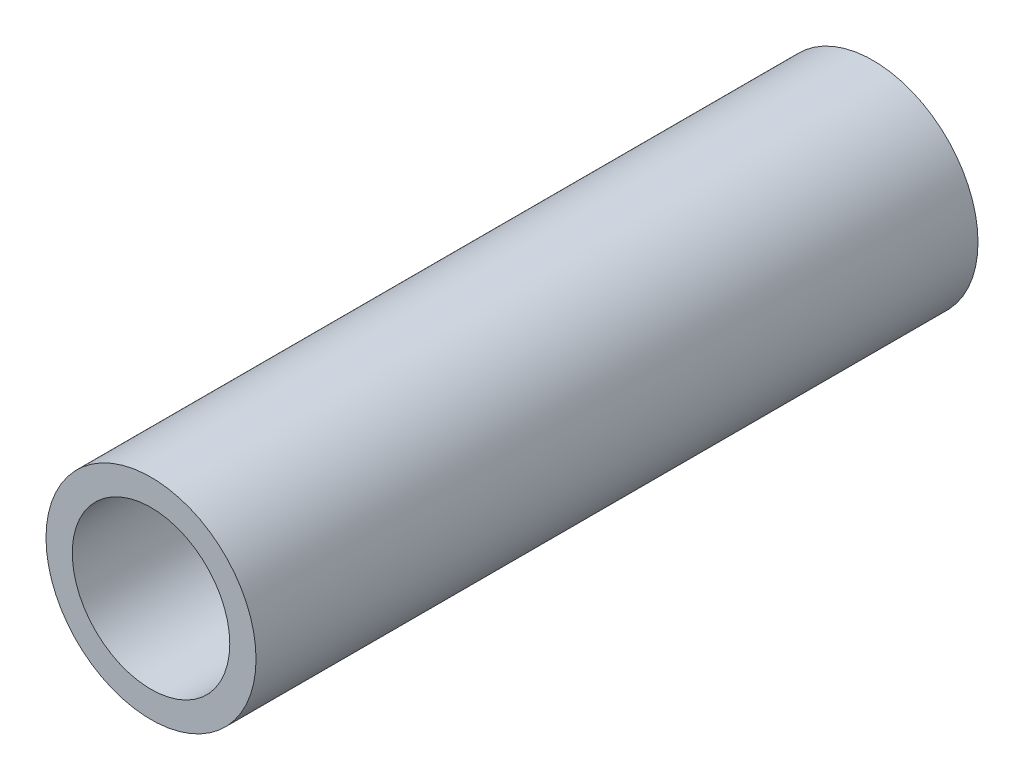
ISO-10303-21;
HEADER;
FILE_DESCRIPTION(('STEP AP214'),'2;1');
FILE_NAME('part.step','',(''),(''),'','','');
FILE_SCHEMA(('AUTOMOTIVE_DESIGN { 1 0 10303 214 1 1 1 1 }'));
ENDSEC;
DATA;
#1=APPLICATION_CONTEXT('core data for automotive mechanical design processes');
#2=APPLICATION_PROTOCOL_DEFINITION('international standard','automotive_design',2000,#1);
#3=PRODUCT_CONTEXT('',#1,'mechanical');
#4=PRODUCT('Part','Part','',(#3));
#5=PRODUCT_RELATED_PRODUCT_CATEGORY('part','',(#4));
#6=PRODUCT_DEFINITION_FORMATION('','',#4);
#7=PRODUCT_DEFINITION_CONTEXT('part definition',#1,'design');
#8=PRODUCT_DEFINITION('design','',#6,#7);
#9=PRODUCT_DEFINITION_SHAPE('','',#8);
#10=(LENGTH_UNIT() NAMED_UNIT(*) SI_UNIT(.MILLI.,.METRE.));
#11=(NAMED_UNIT(*) PLANE_ANGLE_UNIT() SI_UNIT($,.RADIAN.));
#12=(NAMED_UNIT(*) SI_UNIT($,.STERADIAN.) SOLID_ANGLE_UNIT());
#13=UNCERTAINTY_MEASURE_WITH_UNIT(LENGTH_MEASURE(1.E-05),#10,'distance_accuracy_value','');
#14=(GEOMETRIC_REPRESENTATION_CONTEXT(3) GLOBAL_UNCERTAINTY_ASSIGNED_CONTEXT((#13)) GLOBAL_UNIT_ASSIGNED_CONTEXT((#10,
#11,#12)) REPRESENTATION_CONTEXT('',''));
#15=CARTESIAN_POINT('',(0.,0.,0.));
#16=DIRECTION('',(0.,0.,1.));
#17=DIRECTION('',(1.,0.,0.));
#18=AXIS2_PLACEMENT_3D('',#15,#16,#17);
#19=CARTESIAN_POINT('',(0.,0.,55.));
#20=DIRECTION('',(0.,0.,1.));
#21=DIRECTION('',(1.,0.,0.));
#22=AXIS2_PLACEMENT_3D('',#19,#20,#21);
#23=PLANE('',#22);
#24=CARTESIAN_POINT('',(0.,0.,55.));
#25=DIRECTION('',(0.,0.,1.));
#26=DIRECTION('',(1.,0.,0.));
#27=AXIS2_PLACEMENT_3D('',#24,#25,#26);
#28=CIRCLE('',#27,8.);
#29=CARTESIAN_POINT('',(8.,0.,55.));
#30=VERTEX_POINT('',#29);
#31=EDGE_CURVE('E10',#30,#30,#28,.T.);
#32=ORIENTED_EDGE('',*,*,#31,.T.);
#33=EDGE_LOOP('',(#32));
#34=FACE_BOUND('',#33,.T.);
#35=CARTESIAN_POINT('',(0.,0.,55.));
#36=DIRECTION('',(0.,0.,1.));
#37=DIRECTION('',(1.,0.,0.));
#38=AXIS2_PLACEMENT_3D('',#35,#36,#37);
#39=CIRCLE('',#38,6.);
#40=CARTESIAN_POINT('',(6.,0.,55.));
#41=VERTEX_POINT('',#40);
#42=EDGE_CURVE('E43',#41,#41,#39,.T.);
#43=ORIENTED_EDGE('',*,*,#42,.F.);
#44=EDGE_LOOP('',(#43));
#45=FACE_BOUND('',#44,.T.);
#46=ADVANCED_FACE('F32',(#34,#45),#23,.T.);
#47=CARTESIAN_POINT('',(0.,0.,0.));
#48=DIRECTION('',(0.,0.,1.));
#49=DIRECTION('',(1.,0.,0.));
#50=AXIS2_PLACEMENT_3D('',#47,#48,#49);
#51=PLANE('',#50);
#52=CARTESIAN_POINT('',(0.,0.,0.));
#53=DIRECTION('',(0.,0.,1.));
#54=DIRECTION('',(1.,0.,0.));
#55=AXIS2_PLACEMENT_3D('',#52,#53,#54);
#56=CIRCLE('',#55,8.);
#57=CARTESIAN_POINT('',(8.,0.,0.));
#58=VERTEX_POINT('',#57);
#59=EDGE_CURVE('E36',#58,#58,#56,.T.);
#60=ORIENTED_EDGE('',*,*,#59,.F.);
#61=EDGE_LOOP('',(#60));
#62=FACE_BOUND('',#61,.T.);
#63=CARTESIAN_POINT('',(0.,0.,0.));
#64=DIRECTION('',(0.,0.,1.));
#65=DIRECTION('',(1.,0.,0.));
#66=AXIS2_PLACEMENT_3D('',#63,#64,#65);
#67=CIRCLE('',#66,6.);
#68=CARTESIAN_POINT('',(6.,0.,0.));
#69=VERTEX_POINT('',#68);
#70=EDGE_CURVE('E45',#69,#69,#67,.T.);
#71=ORIENTED_EDGE('',*,*,#70,.T.);
#72=EDGE_LOOP('',(#71));
#73=FACE_BOUND('',#72,.T.);
#74=ADVANCED_FACE('F55',(#62,#73),#51,.F.);
#75=CARTESIAN_POINT('',(0.,0.,55.));
#76=DIRECTION('',(0.,0.,-1.));
#77=DIRECTION('',(-1.,0.,0.));
#78=AXIS2_PLACEMENT_3D('',#75,#76,#77);
#79=CYLINDRICAL_SURFACE('',#78,8.);
#80=ORIENTED_EDGE('',*,*,#31,.F.);
#81=EDGE_LOOP('',(#80));
#82=FACE_BOUND('',#81,.T.);
#83=ORIENTED_EDGE('',*,*,#59,.T.);
#84=EDGE_LOOP('',(#83));
#85=FACE_BOUND('',#84,.T.);
#86=ADVANCED_FACE('F34',(#82,#85),#79,.T.);
#87=CARTESIAN_POINT('',(0.,0.,55.));
#88=DIRECTION('',(0.,0.,-1.));
#89=DIRECTION('',(-1.,0.,0.));
#90=AXIS2_PLACEMENT_3D('',#87,#88,#89);
#91=CYLINDRICAL_SURFACE('',#90,6.);
#92=ORIENTED_EDGE('',*,*,#42,.T.);
#93=EDGE_LOOP('',(#92));
#94=FACE_BOUND('',#93,.T.);
#95=ORIENTED_EDGE('',*,*,#70,.F.);
#96=EDGE_LOOP('',(#95));
#97=FACE_BOUND('',#96,.T.);
#98=ADVANCED_FACE('F51',(#94,#97),#91,.F.);
#99=CLOSED_SHELL('',(#46,#74,#86,#98));
#100=MANIFOLD_SOLID_BREP('B2',#99);
#101=ADVANCED_BREP_SHAPE_REPRESENTATION('',(#18,#100),#14);
#102=SHAPE_DEFINITION_REPRESENTATION(#9,#101);
ENDSEC;
END-ISO-10303-21;
